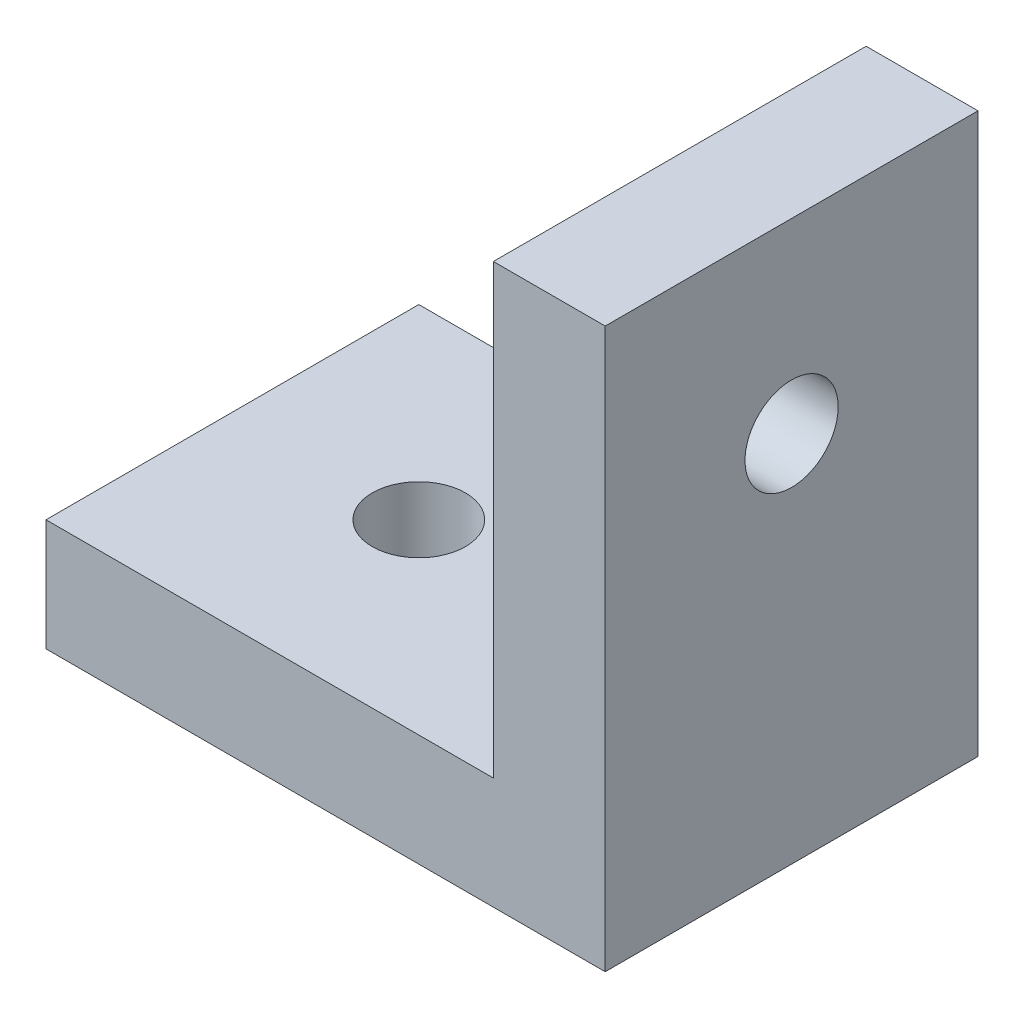
ISO-10303-21;
HEADER;
FILE_DESCRIPTION(('STEP AP214'),'2;1');
FILE_NAME('part.step','',(''),(''),'','','');
FILE_SCHEMA(('AUTOMOTIVE_DESIGN { 1 0 10303 214 1 1 1 1 }'));
ENDSEC;
DATA;
#1=APPLICATION_CONTEXT('core data for automotive mechanical design processes');
#2=APPLICATION_PROTOCOL_DEFINITION('international standard','automotive_design',2000,#1);
#3=PRODUCT_CONTEXT('',#1,'mechanical');
#4=PRODUCT('Part','Part','',(#3));
#5=PRODUCT_RELATED_PRODUCT_CATEGORY('part','',(#4));
#6=PRODUCT_DEFINITION_FORMATION('','',#4);
#7=PRODUCT_DEFINITION_CONTEXT('part definition',#1,'design');
#8=PRODUCT_DEFINITION('design','',#6,#7);
#9=PRODUCT_DEFINITION_SHAPE('','',#8);
#10=(LENGTH_UNIT() NAMED_UNIT(*) SI_UNIT(.MILLI.,.METRE.));
#11=(NAMED_UNIT(*) PLANE_ANGLE_UNIT() SI_UNIT($,.RADIAN.));
#12=(NAMED_UNIT(*) SI_UNIT($,.STERADIAN.) SOLID_ANGLE_UNIT());
#13=UNCERTAINTY_MEASURE_WITH_UNIT(LENGTH_MEASURE(1.E-05),#10,'distance_accuracy_value','');
#14=(GEOMETRIC_REPRESENTATION_CONTEXT(3) GLOBAL_UNCERTAINTY_ASSIGNED_CONTEXT((#13)) GLOBAL_UNIT_ASSIGNED_CONTEXT((#10,
#11,#12)) REPRESENTATION_CONTEXT('',''));
#15=CARTESIAN_POINT('',(0.,0.,0.));
#16=DIRECTION('',(0.,0.,1.));
#17=DIRECTION('',(1.,0.,0.));
#18=AXIS2_PLACEMENT_3D('',#15,#16,#17);
#19=CARTESIAN_POINT('',(7.5,15.,5.));
#20=DIRECTION('',(1.,0.,0.));
#21=DIRECTION('',(0.,0.,-1.));
#22=AXIS2_PLACEMENT_3D('',#19,#20,#21);
#23=PLANE('',#22);
#24=CARTESIAN_POINT('',(7.5,10.,0.));
#25=DIRECTION('',(1.,0.,0.));
#26=DIRECTION('',(0.,0.,-1.));
#27=AXIS2_PLACEMENT_3D('',#24,#25,#26);
#28=CIRCLE('',#27,1.24999999999997);
#29=CARTESIAN_POINT('',(7.5,10.,-1.24999999999997));
#30=VERTEX_POINT('',#29);
#31=EDGE_CURVE('E176',#30,#30,#28,.T.);
#32=ORIENTED_EDGE('',*,*,#31,.F.);
#33=EDGE_LOOP('',(#32));
#34=FACE_BOUND('',#33,.T.);
#35=DIRECTION('',(0.,-1.,0.));
#36=VECTOR('',#35,1.);
#37=CARTESIAN_POINT('',(7.5,15.,-5.));
#38=LINE('',#37,#36);
#39=CARTESIAN_POINT('',(7.5,15.,-5.));
#40=VERTEX_POINT('',#39);
#41=CARTESIAN_POINT('',(7.5,0.,-5.));
#42=VERTEX_POINT('',#41);
#43=EDGE_CURVE('E122',#40,#42,#38,.T.);
#44=ORIENTED_EDGE('',*,*,#43,.F.);
#45=DIRECTION('',(0.,0.,-1.));
#46=VECTOR('',#45,1.);
#47=CARTESIAN_POINT('',(7.5,15.,5.));
#48=LINE('',#47,#46);
#49=CARTESIAN_POINT('',(7.5,15.,5.));
#50=VERTEX_POINT('',#49);
#51=EDGE_CURVE('E11',#50,#40,#48,.T.);
#52=ORIENTED_EDGE('',*,*,#51,.F.);
#53=DIRECTION('',(0.,-1.,0.));
#54=VECTOR('',#53,1.);
#55=CARTESIAN_POINT('',(7.5,15.,5.));
#56=LINE('',#55,#54);
#57=CARTESIAN_POINT('',(7.5,0.,5.));
#58=VERTEX_POINT('',#57);
#59=EDGE_CURVE('E137',#50,#58,#56,.T.);
#60=ORIENTED_EDGE('',*,*,#59,.T.);
#61=DIRECTION('',(0.,0.,-1.));
#62=VECTOR('',#61,1.);
#63=CARTESIAN_POINT('',(7.5,0.,5.));
#64=LINE('',#63,#62);
#65=EDGE_CURVE('E40',#58,#42,#64,.T.);
#66=ORIENTED_EDGE('',*,*,#65,.T.);
#67=EDGE_LOOP('',(#44,#52,#60,#66));
#68=FACE_BOUND('',#67,.T.);
#69=ADVANCED_FACE('F37',(#34,#68),#23,.T.);
#70=CARTESIAN_POINT('',(4.5,15.,5.));
#71=DIRECTION('',(0.,1.,0.));
#72=DIRECTION('',(0.,0.,1.));
#73=AXIS2_PLACEMENT_3D('',#70,#71,#72);
#74=PLANE('',#73);
#75=DIRECTION('',(1.,0.,0.));
#76=VECTOR('',#75,1.);
#77=CARTESIAN_POINT('',(4.5,15.,-5.));
#78=LINE('',#77,#76);
#79=CARTESIAN_POINT('',(4.5,15.,-5.));
#80=VERTEX_POINT('',#79);
#81=EDGE_CURVE('E135',#80,#40,#78,.T.);
#82=ORIENTED_EDGE('',*,*,#81,.F.);
#83=DIRECTION('',(0.,0.,-1.));
#84=VECTOR('',#83,1.);
#85=CARTESIAN_POINT('',(4.5,15.,5.));
#86=LINE('',#85,#84);
#87=CARTESIAN_POINT('',(4.5,15.,5.));
#88=VERTEX_POINT('',#87);
#89=EDGE_CURVE('E46',#88,#80,#86,.T.);
#90=ORIENTED_EDGE('',*,*,#89,.F.);
#91=DIRECTION('',(1.,0.,0.));
#92=VECTOR('',#91,1.);
#93=CARTESIAN_POINT('',(4.5,15.,5.));
#94=LINE('',#93,#92);
#95=EDGE_CURVE('E112',#88,#50,#94,.T.);
#96=ORIENTED_EDGE('',*,*,#95,.T.);
#97=ORIENTED_EDGE('',*,*,#51,.T.);
#98=EDGE_LOOP('',(#82,#90,#96,#97));
#99=FACE_BOUND('',#98,.T.);
#100=ADVANCED_FACE('F145',(#99),#74,.T.);
#101=CARTESIAN_POINT('',(4.5,3.,5.));
#102=DIRECTION('',(-1.,0.,0.));
#103=DIRECTION('',(0.,0.,1.));
#104=AXIS2_PLACEMENT_3D('',#101,#102,#103);
#105=PLANE('',#104);
#106=CARTESIAN_POINT('',(4.5,10.,0.));
#107=DIRECTION('',(-1.,0.,0.));
#108=DIRECTION('',(0.,0.,1.));
#109=AXIS2_PLACEMENT_3D('',#106,#107,#108);
#110=CIRCLE('',#109,1.24999999999997);
#111=CARTESIAN_POINT('',(4.5,10.,1.24999999999997));
#112=VERTEX_POINT('',#111);
#113=EDGE_CURVE('E126',#112,#112,#110,.T.);
#114=ORIENTED_EDGE('',*,*,#113,.F.);
#115=EDGE_LOOP('',(#114));
#116=FACE_BOUND('',#115,.T.);
#117=DIRECTION('',(0.,1.,0.));
#118=VECTOR('',#117,1.);
#119=CARTESIAN_POINT('',(4.5,3.,-5.));
#120=LINE('',#119,#118);
#121=CARTESIAN_POINT('',(4.5,3.,-5.));
#122=VERTEX_POINT('',#121);
#123=EDGE_CURVE('E99',#122,#80,#120,.T.);
#124=ORIENTED_EDGE('',*,*,#123,.F.);
#125=DIRECTION('',(0.,0.,-1.));
#126=VECTOR('',#125,1.);
#127=CARTESIAN_POINT('',(4.5,3.,5.));
#128=LINE('',#127,#126);
#129=CARTESIAN_POINT('',(4.5,3.,5.));
#130=VERTEX_POINT('',#129);
#131=EDGE_CURVE('E94',#130,#122,#128,.T.);
#132=ORIENTED_EDGE('',*,*,#131,.F.);
#133=DIRECTION('',(0.,1.,0.));
#134=VECTOR('',#133,1.);
#135=CARTESIAN_POINT('',(4.5,3.,5.));
#136=LINE('',#135,#134);
#137=EDGE_CURVE('E97',#130,#88,#136,.T.);
#138=ORIENTED_EDGE('',*,*,#137,.T.);
#139=ORIENTED_EDGE('',*,*,#89,.T.);
#140=EDGE_LOOP('',(#124,#132,#138,#139));
#141=FACE_BOUND('',#140,.T.);
#142=ADVANCED_FACE('F96',(#116,#141),#105,.T.);
#143=CARTESIAN_POINT('',(-7.5,3.,5.));
#144=DIRECTION('',(0.,1.,0.));
#145=DIRECTION('',(0.,0.,1.));
#146=AXIS2_PLACEMENT_3D('',#143,#144,#145);
#147=PLANE('',#146);
#148=CARTESIAN_POINT('',(-2.5,3.,0.));
#149=DIRECTION('',(0.,1.,0.));
#150=DIRECTION('',(0.,0.,1.));
#151=AXIS2_PLACEMENT_3D('',#148,#149,#150);
#152=CIRCLE('',#151,1.24999999999997);
#153=CARTESIAN_POINT('',(-2.5,3.,1.24999999999997));
#154=VERTEX_POINT('',#153);
#155=EDGE_CURVE('E173',#154,#154,#152,.T.);
#156=ORIENTED_EDGE('',*,*,#155,.F.);
#157=EDGE_LOOP('',(#156));
#158=FACE_BOUND('',#157,.T.);
#159=DIRECTION('',(1.,0.,0.));
#160=VECTOR('',#159,1.);
#161=CARTESIAN_POINT('',(-7.5,3.,-5.));
#162=LINE('',#161,#160);
#163=CARTESIAN_POINT('',(-7.5,3.,-5.));
#164=VERTEX_POINT('',#163);
#165=EDGE_CURVE('E132',#164,#122,#162,.T.);
#166=ORIENTED_EDGE('',*,*,#165,.F.);
#167=DIRECTION('',(0.,0.,-1.));
#168=VECTOR('',#167,1.);
#169=CARTESIAN_POINT('',(-7.5,3.,5.));
#170=LINE('',#169,#168);
#171=CARTESIAN_POINT('',(-7.5,3.,5.));
#172=VERTEX_POINT('',#171);
#173=EDGE_CURVE('E104',#172,#164,#170,.T.);
#174=ORIENTED_EDGE('',*,*,#173,.F.);
#175=DIRECTION('',(1.,0.,0.));
#176=VECTOR('',#175,1.);
#177=CARTESIAN_POINT('',(-7.5,3.,5.));
#178=LINE('',#177,#176);
#179=EDGE_CURVE('E110',#172,#130,#178,.T.);
#180=ORIENTED_EDGE('',*,*,#179,.T.);
#181=ORIENTED_EDGE('',*,*,#131,.T.);
#182=EDGE_LOOP('',(#166,#174,#180,#181));
#183=FACE_BOUND('',#182,.T.);
#184=ADVANCED_FACE('F114',(#158,#183),#147,.T.);
#185=CARTESIAN_POINT('',(-7.5,0.,5.));
#186=DIRECTION('',(-1.,0.,0.));
#187=DIRECTION('',(0.,0.,1.));
#188=AXIS2_PLACEMENT_3D('',#185,#186,#187);
#189=PLANE('',#188);
#190=DIRECTION('',(0.,1.,0.));
#191=VECTOR('',#190,1.);
#192=CARTESIAN_POINT('',(-7.5,0.,-5.));
#193=LINE('',#192,#191);
#194=CARTESIAN_POINT('',(-7.5,0.,-5.));
#195=VERTEX_POINT('',#194);
#196=EDGE_CURVE('E129',#195,#164,#193,.T.);
#197=ORIENTED_EDGE('',*,*,#196,.F.);
#198=DIRECTION('',(0.,0.,-1.));
#199=VECTOR('',#198,1.);
#200=CARTESIAN_POINT('',(-7.5,0.,5.));
#201=LINE('',#200,#199);
#202=CARTESIAN_POINT('',(-7.5,0.,5.));
#203=VERTEX_POINT('',#202);
#204=EDGE_CURVE('E140',#203,#195,#201,.T.);
#205=ORIENTED_EDGE('',*,*,#204,.F.);
#206=DIRECTION('',(0.,1.,0.));
#207=VECTOR('',#206,1.);
#208=CARTESIAN_POINT('',(-7.5,0.,5.));
#209=LINE('',#208,#207);
#210=EDGE_CURVE('E115',#203,#172,#209,.T.);
#211=ORIENTED_EDGE('',*,*,#210,.T.);
#212=ORIENTED_EDGE('',*,*,#173,.T.);
#213=EDGE_LOOP('',(#197,#205,#211,#212));
#214=FACE_BOUND('',#213,.T.);
#215=ADVANCED_FACE('F160',(#214),#189,.T.);
#216=CARTESIAN_POINT('',(7.5,0.,5.));
#217=DIRECTION('',(0.,-1.,0.));
#218=DIRECTION('',(0.,0.,-1.));
#219=AXIS2_PLACEMENT_3D('',#216,#217,#218);
#220=PLANE('',#219);
#221=CARTESIAN_POINT('',(-2.5,0.,0.));
#222=DIRECTION('',(0.,-1.,0.));
#223=DIRECTION('',(0.,0.,-1.));
#224=AXIS2_PLACEMENT_3D('',#221,#222,#223);
#225=CIRCLE('',#224,1.24999999999997);
#226=CARTESIAN_POINT('',(-2.5,0.,-1.24999999999997));
#227=VERTEX_POINT('',#226);
#228=EDGE_CURVE('E171',#227,#227,#225,.T.);
#229=ORIENTED_EDGE('',*,*,#228,.F.);
#230=EDGE_LOOP('',(#229));
#231=FACE_BOUND('',#230,.T.);
#232=DIRECTION('',(-1.,0.,0.));
#233=VECTOR('',#232,1.);
#234=CARTESIAN_POINT('',(7.5,0.,-5.));
#235=LINE('',#234,#233);
#236=EDGE_CURVE('E125',#42,#195,#235,.T.);
#237=ORIENTED_EDGE('',*,*,#236,.F.);
#238=ORIENTED_EDGE('',*,*,#65,.F.);
#239=DIRECTION('',(-1.,0.,0.));
#240=VECTOR('',#239,1.);
#241=CARTESIAN_POINT('',(7.5,0.,5.));
#242=LINE('',#241,#240);
#243=EDGE_CURVE('E117',#58,#203,#242,.T.);
#244=ORIENTED_EDGE('',*,*,#243,.T.);
#245=ORIENTED_EDGE('',*,*,#204,.T.);
#246=EDGE_LOOP('',(#237,#238,#244,#245));
#247=FACE_BOUND('',#246,.T.);
#248=ADVANCED_FACE('F142',(#231,#247),#220,.T.);
#249=CARTESIAN_POINT('',(0.,0.,5.));
#250=DIRECTION('',(0.,0.,-1.));
#251=DIRECTION('',(-1.,0.,0.));
#252=AXIS2_PLACEMENT_3D('',#249,#250,#251);
#253=PLANE('',#252);
#254=ORIENTED_EDGE('',*,*,#59,.F.);
#255=ORIENTED_EDGE('',*,*,#95,.F.);
#256=ORIENTED_EDGE('',*,*,#137,.F.);
#257=ORIENTED_EDGE('',*,*,#179,.F.);
#258=ORIENTED_EDGE('',*,*,#210,.F.);
#259=ORIENTED_EDGE('',*,*,#243,.F.);
#260=EDGE_LOOP('',(#254,#255,#256,#257,#258,#259));
#261=FACE_BOUND('',#260,.T.);
#262=ADVANCED_FACE('F108',(#261),#253,.F.);
#263=CARTESIAN_POINT('',(0.,0.,-5.));
#264=DIRECTION('',(0.,0.,-1.));
#265=DIRECTION('',(-1.,0.,0.));
#266=AXIS2_PLACEMENT_3D('',#263,#264,#265);
#267=PLANE('',#266);
#268=ORIENTED_EDGE('',*,*,#43,.T.);
#269=ORIENTED_EDGE('',*,*,#236,.T.);
#270=ORIENTED_EDGE('',*,*,#196,.T.);
#271=ORIENTED_EDGE('',*,*,#165,.T.);
#272=ORIENTED_EDGE('',*,*,#123,.T.);
#273=ORIENTED_EDGE('',*,*,#81,.T.);
#274=EDGE_LOOP('',(#268,#269,#270,#271,#272,#273));
#275=FACE_BOUND('',#274,.T.);
#276=ADVANCED_FACE('F144',(#275),#267,.T.);
#277=CARTESIAN_POINT('',(7.5,10.,0.));
#278=DIRECTION('',(1.,0.,0.));
#279=DIRECTION('',(0.,0.,-1.));
#280=AXIS2_PLACEMENT_3D('',#277,#278,#279);
#281=CYLINDRICAL_SURFACE('',#280,1.24999999999997);
#282=ORIENTED_EDGE('',*,*,#113,.T.);
#283=EDGE_LOOP('',(#282));
#284=FACE_BOUND('',#283,.T.);
#285=ORIENTED_EDGE('',*,*,#31,.T.);
#286=EDGE_LOOP('',(#285));
#287=FACE_BOUND('',#286,.T.);
#288=ADVANCED_FACE('F185',(#284,#287),#281,.F.);
#289=CARTESIAN_POINT('',(-2.5,0.,0.));
#290=DIRECTION('',(0.,-1.,0.));
#291=DIRECTION('',(0.,0.,-1.));
#292=AXIS2_PLACEMENT_3D('',#289,#290,#291);
#293=CYLINDRICAL_SURFACE('',#292,1.24999999999997);
#294=ORIENTED_EDGE('',*,*,#155,.T.);
#295=EDGE_LOOP('',(#294));
#296=FACE_BOUND('',#295,.T.);
#297=ORIENTED_EDGE('',*,*,#228,.T.);
#298=EDGE_LOOP('',(#297));
#299=FACE_BOUND('',#298,.T.);
#300=ADVANCED_FACE('F188',(#296,#299),#293,.F.);
#301=CLOSED_SHELL('',(#69,#100,#142,#184,#215,#248,#262,#276,#288,#300));
#302=MANIFOLD_SOLID_BREP('B2',#301);
#303=ADVANCED_BREP_SHAPE_REPRESENTATION('',(#18,#302),#14);
#304=SHAPE_DEFINITION_REPRESENTATION(#9,#303);
ENDSEC;
END-ISO-10303-21;
